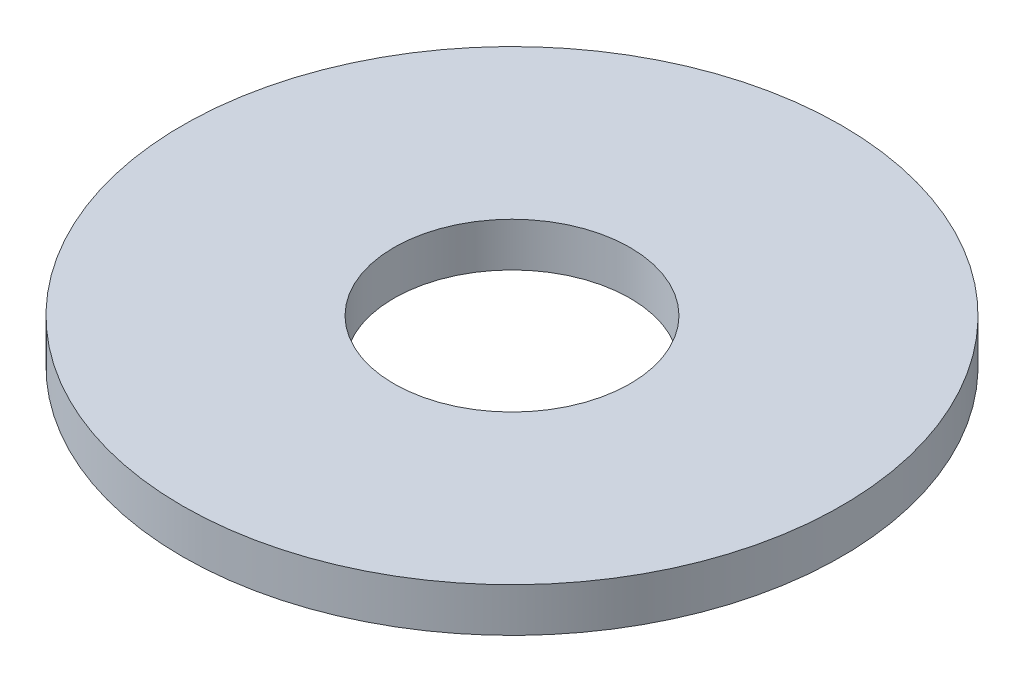
ISO-10303-21;
HEADER;
FILE_DESCRIPTION(('STEP AP214'),'2;1');
FILE_NAME('part.step','',(''),(''),'','','');
FILE_SCHEMA(('AUTOMOTIVE_DESIGN { 1 0 10303 214 1 1 1 1 }'));
ENDSEC;
DATA;
#1=APPLICATION_CONTEXT('core data for automotive mechanical design processes');
#2=APPLICATION_PROTOCOL_DEFINITION('international standard','automotive_design',2000,#1);
#3=PRODUCT_CONTEXT('',#1,'mechanical');
#4=PRODUCT('Part','Part','',(#3));
#5=PRODUCT_RELATED_PRODUCT_CATEGORY('part','',(#4));
#6=PRODUCT_DEFINITION_FORMATION('','',#4);
#7=PRODUCT_DEFINITION_CONTEXT('part definition',#1,'design');
#8=PRODUCT_DEFINITION('design','',#6,#7);
#9=PRODUCT_DEFINITION_SHAPE('','',#8);
#10=(LENGTH_UNIT() NAMED_UNIT(*) SI_UNIT(.MILLI.,.METRE.));
#11=(NAMED_UNIT(*) PLANE_ANGLE_UNIT() SI_UNIT($,.RADIAN.));
#12=(NAMED_UNIT(*) SI_UNIT($,.STERADIAN.) SOLID_ANGLE_UNIT());
#13=UNCERTAINTY_MEASURE_WITH_UNIT(LENGTH_MEASURE(1.E-05),#10,'distance_accuracy_value','');
#14=(GEOMETRIC_REPRESENTATION_CONTEXT(3) GLOBAL_UNCERTAINTY_ASSIGNED_CONTEXT((#13)) GLOBAL_UNIT_ASSIGNED_CONTEXT((#10,
#11,#12)) REPRESENTATION_CONTEXT('',''));
#15=CARTESIAN_POINT('',(0.,0.,0.));
#16=DIRECTION('',(0.,0.,1.));
#17=DIRECTION('',(1.,0.,0.));
#18=AXIS2_PLACEMENT_3D('',#15,#16,#17);
#19=CARTESIAN_POINT('',(0.,1.,0.));
#20=DIRECTION('',(0.,1.,0.));
#21=DIRECTION('',(0.,0.,1.));
#22=AXIS2_PLACEMENT_3D('',#19,#20,#21);
#23=PLANE('',#22);
#24=CARTESIAN_POINT('',(0.,1.,0.));
#25=DIRECTION('',(0.,1.,0.));
#26=DIRECTION('',(0.,0.,1.));
#27=AXIS2_PLACEMENT_3D('',#24,#25,#26);
#28=CIRCLE('',#27,9.);
#29=CARTESIAN_POINT('',(0.,1.,9.));
#30=VERTEX_POINT('',#29);
#31=EDGE_CURVE('E10',#30,#30,#28,.T.);
#32=ORIENTED_EDGE('',*,*,#31,.T.);
#33=EDGE_LOOP('',(#32));
#34=FACE_BOUND('',#33,.T.);
#35=CARTESIAN_POINT('',(0.,1.,0.));
#36=DIRECTION('',(0.,1.,0.));
#37=DIRECTION('',(0.,0.,1.));
#38=AXIS2_PLACEMENT_3D('',#35,#36,#37);
#39=CIRCLE('',#38,3.225);
#40=CARTESIAN_POINT('',(0.,1.,3.225));
#41=VERTEX_POINT('',#40);
#42=EDGE_CURVE('E44',#41,#41,#39,.T.);
#43=ORIENTED_EDGE('',*,*,#42,.F.);
#44=EDGE_LOOP('',(#43));
#45=FACE_BOUND('',#44,.T.);
#46=ADVANCED_FACE('F33',(#34,#45),#23,.T.);
#47=CARTESIAN_POINT('',(0.,-0.2,0.));
#48=DIRECTION('',(0.,1.,0.));
#49=DIRECTION('',(0.,0.,1.));
#50=AXIS2_PLACEMENT_3D('',#47,#48,#49);
#51=PLANE('',#50);
#52=CARTESIAN_POINT('',(0.,-0.2,0.));
#53=DIRECTION('',(0.,1.,0.));
#54=DIRECTION('',(0.,0.,1.));
#55=AXIS2_PLACEMENT_3D('',#52,#53,#54);
#56=CIRCLE('',#55,9.);
#57=CARTESIAN_POINT('',(0.,-0.2,9.));
#58=VERTEX_POINT('',#57);
#59=EDGE_CURVE('E37',#58,#58,#56,.T.);
#60=ORIENTED_EDGE('',*,*,#59,.F.);
#61=EDGE_LOOP('',(#60));
#62=FACE_BOUND('',#61,.T.);
#63=CARTESIAN_POINT('',(0.,-0.2,0.));
#64=DIRECTION('',(0.,1.,0.));
#65=DIRECTION('',(0.,0.,1.));
#66=AXIS2_PLACEMENT_3D('',#63,#64,#65);
#67=CIRCLE('',#66,3.225);
#68=CARTESIAN_POINT('',(0.,-0.2,3.225));
#69=VERTEX_POINT('',#68);
#70=EDGE_CURVE('E46',#69,#69,#67,.T.);
#71=ORIENTED_EDGE('',*,*,#70,.T.);
#72=EDGE_LOOP('',(#71));
#73=FACE_BOUND('',#72,.T.);
#74=ADVANCED_FACE('F56',(#62,#73),#51,.F.);
#75=CARTESIAN_POINT('',(0.,1.,0.));
#76=DIRECTION('',(0.,-1.,0.));
#77=DIRECTION('',(0.,0.,-1.));
#78=AXIS2_PLACEMENT_3D('',#75,#76,#77);
#79=CYLINDRICAL_SURFACE('',#78,9.);
#80=ORIENTED_EDGE('',*,*,#31,.F.);
#81=EDGE_LOOP('',(#80));
#82=FACE_BOUND('',#81,.T.);
#83=ORIENTED_EDGE('',*,*,#59,.T.);
#84=EDGE_LOOP('',(#83));
#85=FACE_BOUND('',#84,.T.);
#86=ADVANCED_FACE('F35',(#82,#85),#79,.T.);
#87=CARTESIAN_POINT('',(0.,1.,0.));
#88=DIRECTION('',(0.,-1.,0.));
#89=DIRECTION('',(0.,0.,-1.));
#90=AXIS2_PLACEMENT_3D('',#87,#88,#89);
#91=CYLINDRICAL_SURFACE('',#90,3.225);
#92=ORIENTED_EDGE('',*,*,#42,.T.);
#93=EDGE_LOOP('',(#92));
#94=FACE_BOUND('',#93,.T.);
#95=ORIENTED_EDGE('',*,*,#70,.F.);
#96=EDGE_LOOP('',(#95));
#97=FACE_BOUND('',#96,.T.);
#98=ADVANCED_FACE('F52',(#94,#97),#91,.F.);
#99=CLOSED_SHELL('',(#46,#74,#86,#98));
#100=MANIFOLD_SOLID_BREP('B2',#99);
#101=ADVANCED_BREP_SHAPE_REPRESENTATION('',(#18,#100),#14);
#102=SHAPE_DEFINITION_REPRESENTATION(#9,#101);
ENDSEC;
END-ISO-10303-21;
